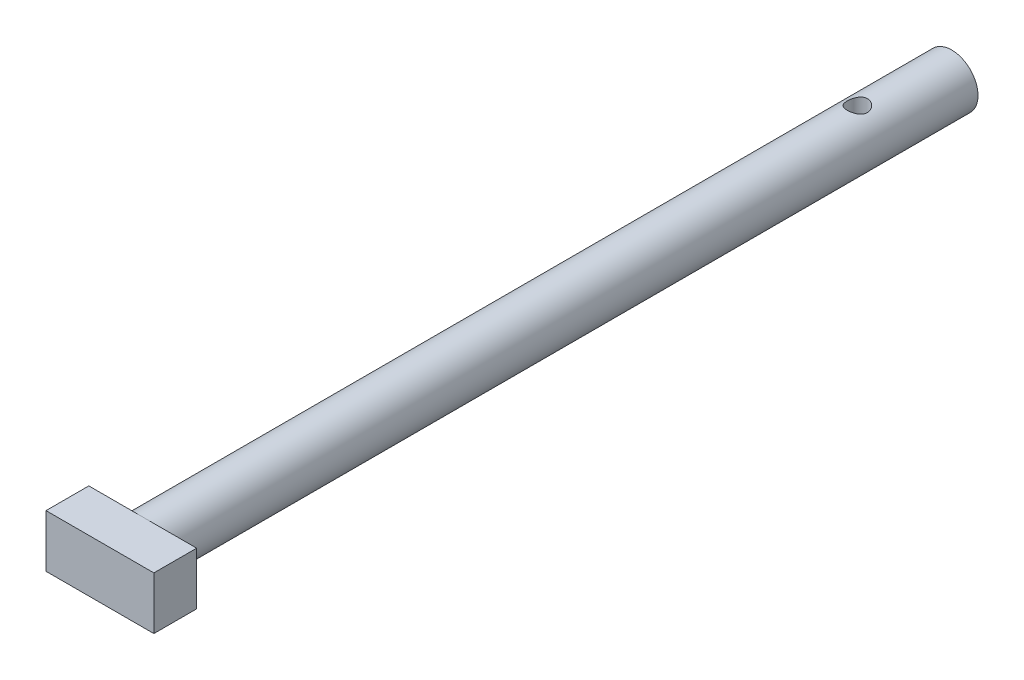
ISO-10303-21;
HEADER;
FILE_DESCRIPTION(('STEP AP214'),'2;1');
FILE_NAME('part.step','',(''),(''),'','','');
FILE_SCHEMA(('AUTOMOTIVE_DESIGN { 1 0 10303 214 1 1 1 1 }'));
ENDSEC;
DATA;
#1=APPLICATION_CONTEXT('core data for automotive mechanical design processes');
#2=APPLICATION_PROTOCOL_DEFINITION('international standard','automotive_design',2000,#1);
#3=PRODUCT_CONTEXT('',#1,'mechanical');
#4=PRODUCT('Part','Part','',(#3));
#5=PRODUCT_RELATED_PRODUCT_CATEGORY('part','',(#4));
#6=PRODUCT_DEFINITION_FORMATION('','',#4);
#7=PRODUCT_DEFINITION_CONTEXT('part definition',#1,'design');
#8=PRODUCT_DEFINITION('design','',#6,#7);
#9=PRODUCT_DEFINITION_SHAPE('','',#8);
#10=(LENGTH_UNIT() NAMED_UNIT(*) SI_UNIT(.MILLI.,.METRE.));
#11=(NAMED_UNIT(*) PLANE_ANGLE_UNIT() SI_UNIT($,.RADIAN.));
#12=(NAMED_UNIT(*) SI_UNIT($,.STERADIAN.) SOLID_ANGLE_UNIT());
#13=UNCERTAINTY_MEASURE_WITH_UNIT(LENGTH_MEASURE(1.E-05),#10,'distance_accuracy_value','');
#14=(GEOMETRIC_REPRESENTATION_CONTEXT(3) GLOBAL_UNCERTAINTY_ASSIGNED_CONTEXT((#13)) GLOBAL_UNIT_ASSIGNED_CONTEXT((#10,
#11,#12)) REPRESENTATION_CONTEXT('',''));
#15=CARTESIAN_POINT('',(0.,0.,0.));
#16=DIRECTION('',(0.,0.,1.));
#17=DIRECTION('',(1.,0.,0.));
#18=AXIS2_PLACEMENT_3D('',#15,#16,#17);
#19=CARTESIAN_POINT('',(0.,0.,60.));
#20=DIRECTION('',(0.,0.,-1.));
#21=DIRECTION('',(-1.,0.,0.));
#22=AXIS2_PLACEMENT_3D('',#19,#20,#21);
#23=CYLINDRICAL_SURFACE('',#22,1.95);
#24=CARTESIAN_POINT('',(-0.75,-1.8,7.));
#25=CARTESIAN_POINT('',(-0.75000191847322,-1.79999815812301,7.04041714222116));
#26=CARTESIAN_POINT('',(-0.746722113827582,-1.80137602363886,7.08082204846057));
#27=CARTESIAN_POINT('',(-0.733753399638935,-1.80669718237358,7.16040865878914));
#28=CARTESIAN_POINT('',(-0.72406493190384,-1.81064029874588,7.19959044700407));
#29=CARTESIAN_POINT('',(-0.698691067124939,-1.82058062256158,7.27555728850982));
#30=CARTESIAN_POINT('',(-0.683020714391643,-1.82657267307121,7.31234808563333));
#31=CARTESIAN_POINT('',(-0.646181570666006,-1.83992719534974,7.38279311301566));
#32=CARTESIAN_POINT('',(-0.625011040849692,-1.8472901002911,7.4164463467862));
#33=CARTESIAN_POINT('',(-0.576585777764425,-1.86298837309952,7.48142258980507));
#34=CARTESIAN_POINT('',(-0.549089362669169,-1.87135335036717,7.51255837433296));
#35=CARTESIAN_POINT('',(-0.489304904184125,-1.88786696058478,7.56990979922494));
#36=CARTESIAN_POINT('',(-0.457015772096785,-1.89601554388231,7.59612431861872));
#37=CARTESIAN_POINT('',(-0.387128371642366,-1.91153250201651,7.64380424184608));
#38=CARTESIAN_POINT('',(-0.349380644537001,-1.91886214784032,7.66506431055083));
#39=CARTESIAN_POINT('',(-0.270512353417121,-1.93155765705378,7.70085394192187));
#40=CARTESIAN_POINT('',(-0.229393031346979,-1.93692423960517,7.71538596990303));
#41=CARTESIAN_POINT('',(-0.146918382502177,-1.94487861405914,7.73664488037806));
#42=CARTESIAN_POINT('',(-0.105657505291112,-1.94758091177864,7.74369449411326));
#43=CARTESIAN_POINT('',(-0.0224557607402877,-1.95031428853198,7.75082448937741));
#44=CARTESIAN_POINT('',(0.0194848690709577,-1.95034628135628,7.7509072549935));
#45=CARTESIAN_POINT('',(0.100535027188066,-1.9478070820486,7.74428497320814));
#46=CARTESIAN_POINT('',(0.139678363817356,-1.9453711715595,7.73793267489221));
#47=CARTESIAN_POINT('',(0.216294085563751,-1.93834916022856,7.71921646481546));
#48=CARTESIAN_POINT('',(0.253766351542,-1.93376290634569,7.70685212517227));
#49=CARTESIAN_POINT('',(0.326635677201053,-1.92280730770759,7.67630868939572));
#50=CARTESIAN_POINT('',(0.361993866231866,-1.91641260382223,7.65804632928673));
#51=CARTESIAN_POINT('',(0.429233135961442,-1.90248250239064,7.61630049626306));
#52=CARTESIAN_POINT('',(0.461113059684536,-1.89494672726803,7.59281529391849));
#53=CARTESIAN_POINT('',(0.522561843235437,-1.87896202983859,7.53961107734794));
#54=CARTESIAN_POINT('',(0.551869619447585,-1.87048544808886,7.50959838538416));
#55=CARTESIAN_POINT('',(0.605137749829175,-1.85393852733059,7.44503973858103));
#56=CARTESIAN_POINT('',(0.629096613747567,-1.84586830202011,7.41049252463294));
#57=CARTESIAN_POINT('',(0.671522034749757,-1.83086822802284,7.33676387793791));
#58=CARTESIAN_POINT('',(0.689840301932477,-1.82397101231615,7.29748993232224));
#59=CARTESIAN_POINT('',(0.719502390732128,-1.81247686685014,7.21607912596394));
#60=CARTESIAN_POINT('',(0.730850336741661,-1.80787857709897,7.17394397464327));
#61=CARTESIAN_POINT('',(0.745640216983926,-1.80182720173735,7.09059693411931));
#62=CARTESIAN_POINT('',(0.749499055370722,-1.80020853830832,7.04947116429633));
#63=CARTESIAN_POINT('',(0.750408999679534,-1.79982977066251,6.96713687491871));
#64=CARTESIAN_POINT('',(0.747461937546824,-1.80106889721385,6.92592838061422));
#65=CARTESIAN_POINT('',(0.735222380873415,-1.80609724522933,6.84680211672373));
#66=CARTESIAN_POINT('',(0.726260937062329,-1.80975328216729,6.80882367171585));
#67=CARTESIAN_POINT('',(0.702668391278806,-1.81904279586217,6.7349297119261));
#68=CARTESIAN_POINT('',(0.688036091408075,-1.82467669039339,6.69901463484698));
#69=CARTESIAN_POINT('',(0.652881670976901,-1.83755486259952,6.62871918951059));
#70=CARTESIAN_POINT('',(0.632153481451348,-1.84485303601286,6.59445204726938));
#71=CARTESIAN_POINT('',(0.585611616105395,-1.86015009037446,6.52973509141649));
#72=CARTESIAN_POINT('',(0.559795997128211,-1.86814923841144,6.49928674369779));
#73=CARTESIAN_POINT('',(0.501757955751817,-1.88459733410998,6.44094427755438));
#74=CARTESIAN_POINT('',(0.469221275376682,-1.89304032142871,6.41335998297574));
#75=CARTESIAN_POINT('',(0.399775452651535,-1.90891242507228,6.36400160495079));
#76=CARTESIAN_POINT('',(0.362866238861109,-1.91634152482749,6.34222761645477));
#77=CARTESIAN_POINT('',(0.285692799531579,-1.92935362573159,6.30522989312857));
#78=CARTESIAN_POINT('',(0.245436670212407,-1.93494092834836,6.2899908706273));
#79=CARTESIAN_POINT('',(0.162666829836521,-1.94364793067953,6.26659251058328));
#80=CARTESIAN_POINT('',(0.120154253211034,-1.94676885805863,6.25842965060841));
#81=CARTESIAN_POINT('',(0.0368714175186543,-1.95006955375813,6.24980972526489));
#82=CARTESIAN_POINT('',(-0.003847107517705,-1.95041699044865,6.24891331943874));
#83=CARTESIAN_POINT('',(-0.0848313268164995,-1.94857469144657,6.25371026314752));
#84=CARTESIAN_POINT('',(-0.12509707988829,-1.9463852891923,6.25940274664854));
#85=CARTESIAN_POINT('',(-0.202936075417885,-1.93979474394292,6.27690488265721));
#86=CARTESIAN_POINT('',(-0.240552511471332,-1.93545425226443,6.28854704651337));
#87=CARTESIAN_POINT('',(-0.313297585701124,-1.92501852584378,6.31744790679745));
#88=CARTESIAN_POINT('',(-0.348425751286495,-1.91892295887207,6.33470766669714));
#89=CARTESIAN_POINT('',(-0.416852288627176,-1.90525691917685,6.37519453356684));
#90=CARTESIAN_POINT('',(-0.450007203314587,-1.89763433072859,6.39864616040276));
#91=CARTESIAN_POINT('',(-0.512044309756483,-1.88184405756168,6.45050333362672));
#92=CARTESIAN_POINT('',(-0.540924940119643,-1.87367617522104,6.47891068211878));
#93=CARTESIAN_POINT('',(-0.595268023695083,-1.85715055056742,6.54176781430975));
#94=CARTESIAN_POINT('',(-0.620447269637398,-1.84880792365091,6.5764674120524));
#95=CARTESIAN_POINT('',(-0.664636852449943,-1.83338691115279,6.64986676909444));
#96=CARTESIAN_POINT('',(-0.683645914274084,-1.82630878701177,6.68856735300731));
#97=CARTESIAN_POINT('',(-0.715866271322303,-1.81393397025173,6.77164241848313));
#98=CARTESIAN_POINT('',(-0.728610143980439,-1.80878632736497,6.8162229291599));
#99=CARTESIAN_POINT('',(-0.745672696168815,-1.80182166863759,6.90720861156291));
#100=CARTESIAN_POINT('',(-0.749997798126463,-1.80000211396237,6.95361236479872));
#101=CARTESIAN_POINT('',(-0.75,-1.8,7.));
#102=B_SPLINE_CURVE_WITH_KNOTS('',3,(#24,#25,#26,#27,#28,#29,#30,#31,#32,#33,#34,#35,#36,#37,
#38,#39,#40,#41,#42,#43,#44,#45,#46,#47,#48,#49,#50,#51,#52,#53,#54,#55,#56,#57,#58,#59,#60,#61,
#62,#63,#64,#65,#66,#67,#68,#69,#70,#71,#72,#73,#74,#75,#76,#77,#78,#79,#80,#81,#82,#83,#84,#85,
#86,#87,#88,#89,#90,#91,#92,#93,#94,#95,#96,#97,#98,#99,#100,#101),.UNSPECIFIED.,.T.,.F.,(4,2,2,
2,2,2,2,2,2,2,2,2,2,2,2,2,2,2,2,2,2,2,2,2,2,2,2,2,2,2,2,2,2,2,2,2,2,2,4),(0.,0.12107846652709,
0.242148586875009,0.362916203466646,0.483722046045391,0.610279466548758,0.73686567953331,
0.868016489617292,0.999119204802279,1.12430358565961,1.24944512767774,1.36807918755121,
1.48672169195304,1.60711822995836,1.72755469415933,1.85536656315057,1.98321399726622,
2.11418116719433,2.24507076800099,2.36843763462211,2.49177129843561,2.60881924396513,
2.72589192791548,2.84749649502514,2.96914759965127,3.0989860945779,3.22882671115674,
3.35836190381954,3.48783257826859,3.60941208253586,3.73097560838661,3.84929145473027,
3.96762971258576,4.0910522196886,4.21451970219818,4.34492398165586,4.47535519155284,
4.61442572141392,4.75339011689877),.UNSPECIFIED.);
#103=CARTESIAN_POINT('',(-0.75,-1.8,7.));
#104=VERTEX_POINT('',#103);
#105=EDGE_CURVE('E41',#104,#104,#102,.T.);
#106=ORIENTED_EDGE('',*,*,#105,.T.);
#107=EDGE_LOOP('',(#106));
#108=FACE_BOUND('',#107,.T.);
#109=CARTESIAN_POINT('',(-0.75,1.8,7.));
#110=CARTESIAN_POINT('',(-0.750001918473221,1.79999815812301,6.95958285777884));
#111=CARTESIAN_POINT('',(-0.746722113827583,1.80137602363886,6.91917795153943));
#112=CARTESIAN_POINT('',(-0.733753399638936,1.80669718237358,6.83959134121086));
#113=CARTESIAN_POINT('',(-0.724064931903841,1.81064029874588,6.80040955299593));
#114=CARTESIAN_POINT('',(-0.698691067124939,1.82058062256158,6.72444271149018));
#115=CARTESIAN_POINT('',(-0.683020714391643,1.82657267307121,6.68765191436667));
#116=CARTESIAN_POINT('',(-0.646181570666006,1.83992719534974,6.61720688698434));
#117=CARTESIAN_POINT('',(-0.625011040849693,1.8472901002911,6.5835536532138));
#118=CARTESIAN_POINT('',(-0.576585777764426,1.86298837309952,6.51857741019493));
#119=CARTESIAN_POINT('',(-0.54908936266917,1.87135335036717,6.48744162566704));
#120=CARTESIAN_POINT('',(-0.489304904184126,1.88786696058478,6.43009020077506));
#121=CARTESIAN_POINT('',(-0.457015772096786,1.89601554388231,6.40387568138128));
#122=CARTESIAN_POINT('',(-0.387128371642367,1.91153250201651,6.35619575815392));
#123=CARTESIAN_POINT('',(-0.349380644537002,1.91886214784032,6.33493568944917));
#124=CARTESIAN_POINT('',(-0.270512353417121,1.93155765705378,6.29914605807813));
#125=CARTESIAN_POINT('',(-0.229393031346979,1.93692423960517,6.28461403009697));
#126=CARTESIAN_POINT('',(-0.146918382502177,1.94487861405914,6.26335511962194));
#127=CARTESIAN_POINT('',(-0.105657505291113,1.94758091177864,6.25630550588674));
#128=CARTESIAN_POINT('',(-0.0224557607402886,1.95031428853198,6.24917551062259));
#129=CARTESIAN_POINT('',(0.0194848690709568,1.95034628135628,6.2490927450065));
#130=CARTESIAN_POINT('',(0.100535027188065,1.9478070820486,6.25571502679186));
#131=CARTESIAN_POINT('',(0.139678363817355,1.9453711715595,6.26206732510779));
#132=CARTESIAN_POINT('',(0.21629408556375,1.93834916022856,6.28078353518454));
#133=CARTESIAN_POINT('',(0.253766351541999,1.93376290634569,6.29314787482773));
#134=CARTESIAN_POINT('',(0.326635677201052,1.92280730770759,6.32369131060428));
#135=CARTESIAN_POINT('',(0.361993866231865,1.91641260382223,6.34195367071327));
#136=CARTESIAN_POINT('',(0.429233135961441,1.90248250239064,6.38369950373694));
#137=CARTESIAN_POINT('',(0.461113059684536,1.89494672726803,6.40718470608151));
#138=CARTESIAN_POINT('',(0.522561843235437,1.87896202983859,6.46038892265206));
#139=CARTESIAN_POINT('',(0.551869619447585,1.87048544808886,6.49040161461584));
#140=CARTESIAN_POINT('',(0.605137749829174,1.85393852733059,6.55496026141897));
#141=CARTESIAN_POINT('',(0.629096613747567,1.84586830202011,6.58950747536706));
#142=CARTESIAN_POINT('',(0.671522034749757,1.83086822802284,6.66323612206209));
#143=CARTESIAN_POINT('',(0.689840301932477,1.82397101231615,6.70251006767776));
#144=CARTESIAN_POINT('',(0.719502390732127,1.81247686685014,6.78392087403606));
#145=CARTESIAN_POINT('',(0.73085033674166,1.80787857709897,6.82605602535673));
#146=CARTESIAN_POINT('',(0.745640216983925,1.80182720173735,6.90940306588069));
#147=CARTESIAN_POINT('',(0.749499055370721,1.80020853830832,6.95052883570367));
#148=CARTESIAN_POINT('',(0.750408999679534,1.79982977066251,7.03286312508129));
#149=CARTESIAN_POINT('',(0.747461937546824,1.80106889721385,7.07407161938578));
#150=CARTESIAN_POINT('',(0.735222380873415,1.80609724522933,7.15319788327627));
#151=CARTESIAN_POINT('',(0.726260937062328,1.80975328216729,7.19117632828415));
#152=CARTESIAN_POINT('',(0.702668391278805,1.81904279586217,7.2650702880739));
#153=CARTESIAN_POINT('',(0.688036091408074,1.82467669039339,7.30098536515302));
#154=CARTESIAN_POINT('',(0.6528816709769,1.83755486259952,7.37128081048941));
#155=CARTESIAN_POINT('',(0.632153481451348,1.84485303601286,7.40554795273062));
#156=CARTESIAN_POINT('',(0.585611616105395,1.86015009037446,7.47026490858351));
#157=CARTESIAN_POINT('',(0.559795997128211,1.86814923841144,7.50071325630221));
#158=CARTESIAN_POINT('',(0.501757955751817,1.88459733410998,7.55905572244562));
#159=CARTESIAN_POINT('',(0.469221275376682,1.89304032142872,7.58664001702426));
#160=CARTESIAN_POINT('',(0.399775452651534,1.90891242507228,7.63599839504921));
#161=CARTESIAN_POINT('',(0.362866238861109,1.91634152482749,7.65777238354523));
#162=CARTESIAN_POINT('',(0.285692799531578,1.92935362573159,7.69477010687143));
#163=CARTESIAN_POINT('',(0.245436670212406,1.93494092834836,7.7100091293727));
#164=CARTESIAN_POINT('',(0.16266682983652,1.94364793067953,7.73340748941673));
#165=CARTESIAN_POINT('',(0.120154253211034,1.94676885805863,7.74157034939159));
#166=CARTESIAN_POINT('',(0.0368714175186539,1.95006955375813,7.75019027473511));
#167=CARTESIAN_POINT('',(-0.00384710751770539,1.95041699044865,7.75108668056126));
#168=CARTESIAN_POINT('',(-0.0848313268164999,1.94857469144657,7.74628973685248));
#169=CARTESIAN_POINT('',(-0.12509707988829,1.9463852891923,7.74059725335146));
#170=CARTESIAN_POINT('',(-0.202936075417886,1.93979474394292,7.72309511734279));
#171=CARTESIAN_POINT('',(-0.240552511471332,1.93545425226443,7.71145295348663));
#172=CARTESIAN_POINT('',(-0.313297585701125,1.92501852584378,7.68255209320255));
#173=CARTESIAN_POINT('',(-0.348425751286495,1.91892295887207,7.66529233330286));
#174=CARTESIAN_POINT('',(-0.416852288627176,1.90525691917684,7.62480546643316));
#175=CARTESIAN_POINT('',(-0.450007203314587,1.89763433072859,7.60135383959724));
#176=CARTESIAN_POINT('',(-0.512044309756483,1.88184405756168,7.54949666637328));
#177=CARTESIAN_POINT('',(-0.540924940119643,1.87367617522104,7.52108931788122));
#178=CARTESIAN_POINT('',(-0.595268023695084,1.85715055056742,7.45823218569025));
#179=CARTESIAN_POINT('',(-0.620447269637398,1.84880792365091,7.4235325879476));
#180=CARTESIAN_POINT('',(-0.664636852449944,1.83338691115279,7.35013323090556));
#181=CARTESIAN_POINT('',(-0.683645914274085,1.82630878701177,7.31143264699269));
#182=CARTESIAN_POINT('',(-0.715866271322304,1.81393397025173,7.22835758151687));
#183=CARTESIAN_POINT('',(-0.72861014398044,1.80878632736497,7.18377707084011));
#184=CARTESIAN_POINT('',(-0.745672696168816,1.80182166863759,7.09279138843709));
#185=CARTESIAN_POINT('',(-0.749997798126463,1.80000211396237,7.04638763520128));
#186=CARTESIAN_POINT('',(-0.75,1.8,7.));
#187=B_SPLINE_CURVE_WITH_KNOTS('',3,(#109,#110,#111,#112,#113,#114,#115,#116,#117,#118,#119,
#120,#121,#122,#123,#124,#125,#126,#127,#128,#129,#130,#131,#132,#133,#134,#135,#136,#137,#138,
#139,#140,#141,#142,#143,#144,#145,#146,#147,#148,#149,#150,#151,#152,#153,#154,#155,#156,#157,
#158,#159,#160,#161,#162,#163,#164,#165,#166,#167,#168,#169,#170,#171,#172,#173,#174,#175,#176,
#177,#178,#179,#180,#181,#182,#183,#184,#185,#186),.UNSPECIFIED.,.T.,.F.,(4,2,2,2,2,2,2,2,2,2,2,
2,2,2,2,2,2,2,2,2,2,2,2,2,2,2,2,2,2,2,2,2,2,2,2,2,2,2,4),(0.,0.12107846652709,0.242148586875009,
0.362916203466647,0.483722046045391,0.610279466548758,0.73686567953331,0.868016489617293,
0.999119204802279,1.12430358565961,1.24944512767774,1.36807918755121,1.48672169195304,
1.60711822995836,1.72755469415933,1.85536656315057,1.98321399726622,2.11418116719433,
2.24507076800099,2.36843763462211,2.49177129843561,2.60881924396513,2.72589192791548,
2.84749649502514,2.96914759965127,3.0989860945779,3.22882671115674,3.35836190381954,
3.48783257826859,3.60941208253586,3.73097560838661,3.84929145473027,3.96762971258576,
4.09105221968859,4.21451970219817,4.34492398165586,4.47535519155284,4.61442572141392,
4.75339011689877),.UNSPECIFIED.);
#188=CARTESIAN_POINT('',(-0.75,1.8,7.));
#189=VERTEX_POINT('',#188);
#190=EDGE_CURVE('E11',#189,#189,#187,.T.);
#191=ORIENTED_EDGE('',*,*,#190,.T.);
#192=EDGE_LOOP('',(#191));
#193=FACE_BOUND('',#192,.T.);
#194=CARTESIAN_POINT('',(0.,0.,60.));
#195=DIRECTION('',(0.,0.,1.));
#196=DIRECTION('',(1.,0.,0.));
#197=AXIS2_PLACEMENT_3D('',#194,#195,#196);
#198=CIRCLE('',#197,1.95);
#199=CARTESIAN_POINT('',(0.,1.95,60.));
#200=VERTEX_POINT('',#199);
#201=CARTESIAN_POINT('',(0.,-1.95,60.));
#202=VERTEX_POINT('',#201);
#203=EDGE_CURVE('E50',#200,#202,#198,.T.);
#204=ORIENTED_EDGE('',*,*,#203,.F.);
#205=EDGE_CURVE('E56',#202,#200,#198,.T.);
#206=ORIENTED_EDGE('',*,*,#205,.F.);
#207=EDGE_LOOP('',(#204,#206));
#208=FACE_BOUND('',#207,.T.);
#209=CARTESIAN_POINT('',(0.,0.,0.));
#210=DIRECTION('',(0.,0.,1.));
#211=DIRECTION('',(1.,0.,0.));
#212=AXIS2_PLACEMENT_3D('',#209,#210,#211);
#213=CIRCLE('',#212,1.95);
#214=CARTESIAN_POINT('',(1.95,0.,0.));
#215=VERTEX_POINT('',#214);
#216=EDGE_CURVE('E111',#215,#215,#213,.T.);
#217=ORIENTED_EDGE('',*,*,#216,.T.);
#218=EDGE_LOOP('',(#217));
#219=FACE_BOUND('',#218,.T.);
#220=ADVANCED_FACE('F37',(#108,#193,#208,#219),#23,.T.);
#221=CARTESIAN_POINT('',(0.,0.,0.));
#222=DIRECTION('',(0.,0.,1.));
#223=DIRECTION('',(1.,0.,0.));
#224=AXIS2_PLACEMENT_3D('',#221,#222,#223);
#225=PLANE('',#224);
#226=ORIENTED_EDGE('',*,*,#216,.F.);
#227=EDGE_LOOP('',(#226));
#228=FACE_BOUND('',#227,.T.);
#229=ADVANCED_FACE('F135',(#228),#225,.F.);
#230=CARTESIAN_POINT('',(0.,0.,60.));
#231=DIRECTION('',(0.,0.,1.));
#232=DIRECTION('',(1.,0.,0.));
#233=AXIS2_PLACEMENT_3D('',#230,#231,#232);
#234=PLANE('',#233);
#235=DIRECTION('',(-1.,0.,0.));
#236=VECTOR('',#235,1.);
#237=CARTESIAN_POINT('',(-4.,1.95,60.));
#238=LINE('',#237,#236);
#239=CARTESIAN_POINT('',(-4.,1.95,60.));
#240=VERTEX_POINT('',#239);
#241=EDGE_CURVE('E171',#200,#240,#238,.T.);
#242=ORIENTED_EDGE('',*,*,#241,.F.);
#243=ORIENTED_EDGE('',*,*,#203,.T.);
#244=DIRECTION('',(1.,0.,0.));
#245=VECTOR('',#244,1.);
#246=CARTESIAN_POINT('',(-4.,-1.95,60.));
#247=LINE('',#246,#245);
#248=CARTESIAN_POINT('',(-4.,-1.95,60.));
#249=VERTEX_POINT('',#248);
#250=EDGE_CURVE('E164',#249,#202,#247,.T.);
#251=ORIENTED_EDGE('',*,*,#250,.F.);
#252=DIRECTION('',(0.,-1.,0.));
#253=VECTOR('',#252,1.);
#254=CARTESIAN_POINT('',(-4.,1.95,60.));
#255=LINE('',#254,#253);
#256=EDGE_CURVE('E110',#240,#249,#255,.T.);
#257=ORIENTED_EDGE('',*,*,#256,.F.);
#258=EDGE_LOOP('',(#242,#243,#251,#257));
#259=FACE_BOUND('',#258,.T.);
#260=ADVANCED_FACE('F131',(#259),#234,.F.);
#261=CARTESIAN_POINT('',(4.,-1.95,60.));
#262=VERTEX_POINT('',#261);
#263=EDGE_CURVE('E162',#202,#262,#247,.T.);
#264=ORIENTED_EDGE('',*,*,#263,.F.);
#265=ORIENTED_EDGE('',*,*,#205,.T.);
#266=CARTESIAN_POINT('',(4.,1.95,60.));
#267=VERTEX_POINT('',#266);
#268=EDGE_CURVE('E106',#267,#200,#238,.T.);
#269=ORIENTED_EDGE('',*,*,#268,.F.);
#270=DIRECTION('',(0.,1.,0.));
#271=VECTOR('',#270,1.);
#272=CARTESIAN_POINT('',(4.,1.95,60.));
#273=LINE('',#272,#271);
#274=EDGE_CURVE('E169',#262,#267,#273,.T.);
#275=ORIENTED_EDGE('',*,*,#274,.F.);
#276=EDGE_LOOP('',(#264,#265,#269,#275));
#277=FACE_BOUND('',#276,.T.);
#278=ADVANCED_FACE('F134',(#277),#234,.F.);
#279=CARTESIAN_POINT('',(-4.,1.95,63.175));
#280=DIRECTION('',(1.,0.,0.));
#281=DIRECTION('',(0.,0.,-1.));
#282=AXIS2_PLACEMENT_3D('',#279,#280,#281);
#283=PLANE('',#282);
#284=ORIENTED_EDGE('',*,*,#256,.T.);
#285=DIRECTION('',(0.,0.,-1.));
#286=VECTOR('',#285,1.);
#287=CARTESIAN_POINT('',(-4.,-1.95,63.175));
#288=LINE('',#287,#286);
#289=CARTESIAN_POINT('',(-4.,-1.95,63.175));
#290=VERTEX_POINT('',#289);
#291=EDGE_CURVE('E90',#290,#249,#288,.T.);
#292=ORIENTED_EDGE('',*,*,#291,.F.);
#293=DIRECTION('',(0.,-1.,0.));
#294=VECTOR('',#293,1.);
#295=CARTESIAN_POINT('',(-4.,1.95,63.175));
#296=LINE('',#295,#294);
#297=CARTESIAN_POINT('',(-4.,1.95,63.175));
#298=VERTEX_POINT('',#297);
#299=EDGE_CURVE('E97',#298,#290,#296,.T.);
#300=ORIENTED_EDGE('',*,*,#299,.F.);
#301=DIRECTION('',(0.,0.,-1.));
#302=VECTOR('',#301,1.);
#303=CARTESIAN_POINT('',(-4.,1.95,63.175));
#304=LINE('',#303,#302);
#305=EDGE_CURVE('E174',#298,#240,#304,.T.);
#306=ORIENTED_EDGE('',*,*,#305,.T.);
#307=EDGE_LOOP('',(#284,#292,#300,#306));
#308=FACE_BOUND('',#307,.T.);
#309=ADVANCED_FACE('F108',(#308),#283,.F.);
#310=CARTESIAN_POINT('',(-4.,-1.95,63.175));
#311=DIRECTION('',(0.,1.,0.));
#312=DIRECTION('',(0.,0.,1.));
#313=AXIS2_PLACEMENT_3D('',#310,#311,#312);
#314=PLANE('',#313);
#315=ORIENTED_EDGE('',*,*,#250,.T.);
#316=ORIENTED_EDGE('',*,*,#263,.T.);
#317=DIRECTION('',(0.,0.,-1.));
#318=VECTOR('',#317,1.);
#319=CARTESIAN_POINT('',(4.,-1.95,63.175));
#320=LINE('',#319,#318);
#321=CARTESIAN_POINT('',(4.,-1.95,63.175));
#322=VERTEX_POINT('',#321);
#323=EDGE_CURVE('E93',#322,#262,#320,.T.);
#324=ORIENTED_EDGE('',*,*,#323,.F.);
#325=DIRECTION('',(1.,0.,0.));
#326=VECTOR('',#325,1.);
#327=CARTESIAN_POINT('',(-4.,-1.95,63.175));
#328=LINE('',#327,#326);
#329=EDGE_CURVE('E85',#290,#322,#328,.T.);
#330=ORIENTED_EDGE('',*,*,#329,.F.);
#331=ORIENTED_EDGE('',*,*,#291,.T.);
#332=EDGE_LOOP('',(#315,#316,#324,#330,#331));
#333=FACE_BOUND('',#332,.T.);
#334=ADVANCED_FACE('F88',(#333),#314,.F.);
#335=CARTESIAN_POINT('',(4.,1.95,63.175));
#336=DIRECTION('',(-1.,0.,0.));
#337=DIRECTION('',(0.,0.,1.));
#338=AXIS2_PLACEMENT_3D('',#335,#336,#337);
#339=PLANE('',#338);
#340=ORIENTED_EDGE('',*,*,#274,.T.);
#341=DIRECTION('',(0.,0.,-1.));
#342=VECTOR('',#341,1.);
#343=CARTESIAN_POINT('',(4.,1.95,63.175));
#344=LINE('',#343,#342);
#345=CARTESIAN_POINT('',(4.,1.95,63.175));
#346=VERTEX_POINT('',#345);
#347=EDGE_CURVE('E115',#346,#267,#344,.T.);
#348=ORIENTED_EDGE('',*,*,#347,.F.);
#349=DIRECTION('',(0.,1.,0.));
#350=VECTOR('',#349,1.);
#351=CARTESIAN_POINT('',(4.,1.95,63.175));
#352=LINE('',#351,#350);
#353=EDGE_CURVE('E96',#322,#346,#352,.T.);
#354=ORIENTED_EDGE('',*,*,#353,.F.);
#355=ORIENTED_EDGE('',*,*,#323,.T.);
#356=EDGE_LOOP('',(#340,#348,#354,#355));
#357=FACE_BOUND('',#356,.T.);
#358=ADVANCED_FACE('F139',(#357),#339,.F.);
#359=CARTESIAN_POINT('',(-4.,1.95,63.175));
#360=DIRECTION('',(0.,-1.,0.));
#361=DIRECTION('',(1.,0.,0.));
#362=AXIS2_PLACEMENT_3D('',#359,#360,#361);
#363=PLANE('',#362);
#364=ORIENTED_EDGE('',*,*,#268,.T.);
#365=ORIENTED_EDGE('',*,*,#241,.T.);
#366=ORIENTED_EDGE('',*,*,#305,.F.);
#367=DIRECTION('',(-1.,0.,0.));
#368=VECTOR('',#367,1.);
#369=CARTESIAN_POINT('',(-4.,1.95,63.175));
#370=LINE('',#369,#368);
#371=EDGE_CURVE('E102',#346,#298,#370,.T.);
#372=ORIENTED_EDGE('',*,*,#371,.F.);
#373=ORIENTED_EDGE('',*,*,#347,.T.);
#374=EDGE_LOOP('',(#364,#365,#366,#372,#373));
#375=FACE_BOUND('',#374,.T.);
#376=ADVANCED_FACE('F130',(#375),#363,.F.);
#377=CARTESIAN_POINT('',(0.,0.,63.175));
#378=DIRECTION('',(0.,0.,1.));
#379=DIRECTION('',(1.,0.,0.));
#380=AXIS2_PLACEMENT_3D('',#377,#378,#379);
#381=PLANE('',#380);
#382=ORIENTED_EDGE('',*,*,#299,.T.);
#383=ORIENTED_EDGE('',*,*,#329,.T.);
#384=ORIENTED_EDGE('',*,*,#353,.T.);
#385=ORIENTED_EDGE('',*,*,#371,.T.);
#386=EDGE_LOOP('',(#382,#383,#384,#385));
#387=FACE_BOUND('',#386,.T.);
#388=ADVANCED_FACE('F100',(#387),#381,.T.);
#389=CARTESIAN_POINT('',(0.,-3.05,7.));
#390=DIRECTION('',(0.,1.,0.));
#391=DIRECTION('',(-1.,0.,0.));
#392=AXIS2_PLACEMENT_3D('',#389,#390,#391);
#393=CYLINDRICAL_SURFACE('',#392,0.75);
#394=ORIENTED_EDGE('',*,*,#190,.F.);
#395=EDGE_LOOP('',(#394));
#396=FACE_BOUND('',#395,.T.);
#397=ORIENTED_EDGE('',*,*,#105,.F.);
#398=EDGE_LOOP('',(#397));
#399=FACE_BOUND('',#398,.T.);
#400=ADVANCED_FACE('F122',(#396,#399),#393,.F.);
#401=CLOSED_SHELL('',(#220,#229,#260,#278,#309,#334,#358,#376,#388,#400));
#402=MANIFOLD_SOLID_BREP('B2',#401);
#403=ADVANCED_BREP_SHAPE_REPRESENTATION('',(#18,#402),#14);
#404=SHAPE_DEFINITION_REPRESENTATION(#9,#403);
ENDSEC;
END-ISO-10303-21;
